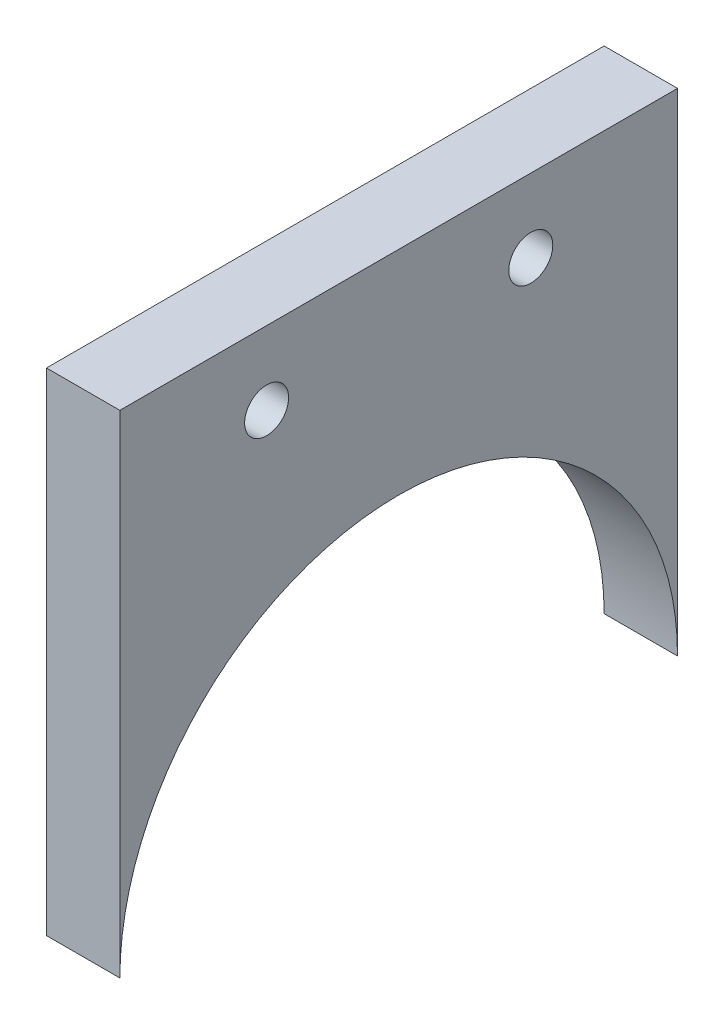
ISO-10303-21;
HEADER;
FILE_DESCRIPTION(('STEP AP214'),'2;1');
FILE_NAME('part.step','',(''),(''),'','','');
FILE_SCHEMA(('AUTOMOTIVE_DESIGN { 1 0 10303 214 1 1 1 1 }'));
ENDSEC;
DATA;
#1=APPLICATION_CONTEXT('core data for automotive mechanical design processes');
#2=APPLICATION_PROTOCOL_DEFINITION('international standard','automotive_design',2000,#1);
#3=PRODUCT_CONTEXT('',#1,'mechanical');
#4=PRODUCT('Part','Part','',(#3));
#5=PRODUCT_RELATED_PRODUCT_CATEGORY('part','',(#4));
#6=PRODUCT_DEFINITION_FORMATION('','',#4);
#7=PRODUCT_DEFINITION_CONTEXT('part definition',#1,'design');
#8=PRODUCT_DEFINITION('design','',#6,#7);
#9=PRODUCT_DEFINITION_SHAPE('','',#8);
#10=(LENGTH_UNIT() NAMED_UNIT(*) SI_UNIT(.MILLI.,.METRE.));
#11=(NAMED_UNIT(*) PLANE_ANGLE_UNIT() SI_UNIT($,.RADIAN.));
#12=(NAMED_UNIT(*) SI_UNIT($,.STERADIAN.) SOLID_ANGLE_UNIT());
#13=UNCERTAINTY_MEASURE_WITH_UNIT(LENGTH_MEASURE(1.E-05),#10,'distance_accuracy_value','');
#14=(GEOMETRIC_REPRESENTATION_CONTEXT(3) GLOBAL_UNCERTAINTY_ASSIGNED_CONTEXT((#13)) GLOBAL_UNIT_ASSIGNED_CONTEXT((#10,
#11,#12)) REPRESENTATION_CONTEXT('',''));
#15=CARTESIAN_POINT('',(0.,0.,0.));
#16=DIRECTION('',(0.,0.,1.));
#17=DIRECTION('',(1.,0.,0.));
#18=AXIS2_PLACEMENT_3D('',#15,#16,#17);
#19=CARTESIAN_POINT('',(5.,16.75,19.));
#20=DIRECTION('',(0.,0.,-1.));
#21=DIRECTION('',(0.,1.,0.));
#22=AXIS2_PLACEMENT_3D('',#19,#20,#21);
#23=PLANE('',#22);
#24=DIRECTION('',(0.,-1.,0.));
#25=VECTOR('',#24,1.);
#26=CARTESIAN_POINT('',(0.,16.75,19.));
#27=LINE('',#26,#25);
#28=CARTESIAN_POINT('',(0.,16.75,19.));
#29=VERTEX_POINT('',#28);
#30=CARTESIAN_POINT('',(0.,-16.75,19.));
#31=VERTEX_POINT('',#30);
#32=EDGE_CURVE('E85',#29,#31,#27,.T.);
#33=ORIENTED_EDGE('',*,*,#32,.T.);
#34=DIRECTION('',(-1.,0.,0.));
#35=VECTOR('',#34,1.);
#36=CARTESIAN_POINT('',(5.,-16.75,19.));
#37=LINE('',#36,#35);
#38=CARTESIAN_POINT('',(5.,-16.75,19.));
#39=VERTEX_POINT('',#38);
#40=EDGE_CURVE('E11',#39,#31,#37,.T.);
#41=ORIENTED_EDGE('',*,*,#40,.F.);
#42=DIRECTION('',(0.,-1.,0.));
#43=VECTOR('',#42,1.);
#44=CARTESIAN_POINT('',(5.,16.75,19.));
#45=LINE('',#44,#43);
#46=CARTESIAN_POINT('',(5.,16.75,19.));
#47=VERTEX_POINT('',#46);
#48=EDGE_CURVE('E80',#47,#39,#45,.T.);
#49=ORIENTED_EDGE('',*,*,#48,.F.);
#50=DIRECTION('',(-1.,0.,0.));
#51=VECTOR('',#50,1.);
#52=CARTESIAN_POINT('',(5.,16.75,19.));
#53=LINE('',#52,#51);
#54=EDGE_CURVE('E75',#47,#29,#53,.T.);
#55=ORIENTED_EDGE('',*,*,#54,.T.);
#56=EDGE_LOOP('',(#33,#41,#49,#55));
#57=FACE_BOUND('',#56,.T.);
#58=ADVANCED_FACE('F38',(#57),#23,.F.);
#59=CARTESIAN_POINT('',(5.,16.75,-19.));
#60=DIRECTION('',(0.,0.,1.));
#61=DIRECTION('',(0.,-1.,0.));
#62=AXIS2_PLACEMENT_3D('',#59,#60,#61);
#63=PLANE('',#62);
#64=DIRECTION('',(0.,1.,0.));
#65=VECTOR('',#64,1.);
#66=CARTESIAN_POINT('',(0.,16.75,-19.));
#67=LINE('',#66,#65);
#68=CARTESIAN_POINT('',(0.,-16.75,-19.));
#69=VERTEX_POINT('',#68);
#70=CARTESIAN_POINT('',(0.,16.75,-19.));
#71=VERTEX_POINT('',#70);
#72=EDGE_CURVE('E67',#69,#71,#67,.T.);
#73=ORIENTED_EDGE('',*,*,#72,.T.);
#74=DIRECTION('',(-1.,0.,0.));
#75=VECTOR('',#74,1.);
#76=CARTESIAN_POINT('',(5.,16.75,-19.));
#77=LINE('',#76,#75);
#78=CARTESIAN_POINT('',(5.,16.75,-19.));
#79=VERTEX_POINT('',#78);
#80=EDGE_CURVE('E77',#79,#71,#77,.T.);
#81=ORIENTED_EDGE('',*,*,#80,.F.);
#82=DIRECTION('',(0.,1.,0.));
#83=VECTOR('',#82,1.);
#84=CARTESIAN_POINT('',(5.,16.75,-19.));
#85=LINE('',#84,#83);
#86=CARTESIAN_POINT('',(5.,-16.75,-19.));
#87=VERTEX_POINT('',#86);
#88=EDGE_CURVE('E103',#87,#79,#85,.T.);
#89=ORIENTED_EDGE('',*,*,#88,.F.);
#90=DIRECTION('',(-1.,0.,0.));
#91=VECTOR('',#90,1.);
#92=CARTESIAN_POINT('',(5.,-16.75,-19.));
#93=LINE('',#92,#91);
#94=EDGE_CURVE('E46',#87,#69,#93,.T.);
#95=ORIENTED_EDGE('',*,*,#94,.T.);
#96=EDGE_LOOP('',(#73,#81,#89,#95));
#97=FACE_BOUND('',#96,.T.);
#98=ADVANCED_FACE('F101',(#97),#63,.F.);
#99=CARTESIAN_POINT('',(5.,16.75,19.));
#100=DIRECTION('',(0.,-1.,0.));
#101=DIRECTION('',(0.,0.,-1.));
#102=AXIS2_PLACEMENT_3D('',#99,#100,#101);
#103=PLANE('',#102);
#104=DIRECTION('',(0.,0.,1.));
#105=VECTOR('',#104,1.);
#106=CARTESIAN_POINT('',(0.,16.75,19.));
#107=LINE('',#106,#105);
#108=EDGE_CURVE('E72',#71,#29,#107,.T.);
#109=ORIENTED_EDGE('',*,*,#108,.T.);
#110=ORIENTED_EDGE('',*,*,#54,.F.);
#111=DIRECTION('',(0.,0.,1.));
#112=VECTOR('',#111,1.);
#113=CARTESIAN_POINT('',(5.,16.75,19.));
#114=LINE('',#113,#112);
#115=EDGE_CURVE('E54',#79,#47,#114,.T.);
#116=ORIENTED_EDGE('',*,*,#115,.F.);
#117=ORIENTED_EDGE('',*,*,#80,.T.);
#118=EDGE_LOOP('',(#109,#110,#116,#117));
#119=FACE_BOUND('',#118,.T.);
#120=ADVANCED_FACE('F74',(#119),#103,.F.);
#121=CARTESIAN_POINT('',(5.,0.,0.));
#122=DIRECTION('',(1.,0.,0.));
#123=DIRECTION('',(0.,0.,-1.));
#124=AXIS2_PLACEMENT_3D('',#121,#122,#123);
#125=PLANE('',#124);
#126=CARTESIAN_POINT('',(5.,11.75,-9.00000000000002));
#127=DIRECTION('',(1.,0.,0.));
#128=DIRECTION('',(0.,0.,-1.));
#129=AXIS2_PLACEMENT_3D('',#126,#127,#128);
#130=CIRCLE('',#129,1.5);
#131=CARTESIAN_POINT('',(5.,11.75,-10.5));
#132=VERTEX_POINT('',#131);
#133=EDGE_CURVE('E118',#132,#132,#130,.T.);
#134=ORIENTED_EDGE('',*,*,#133,.F.);
#135=EDGE_LOOP('',(#134));
#136=FACE_BOUND('',#135,.T.);
#137=CARTESIAN_POINT('',(5.,11.75,8.99999999999999));
#138=DIRECTION('',(1.,0.,0.));
#139=DIRECTION('',(0.,0.,-1.));
#140=AXIS2_PLACEMENT_3D('',#137,#138,#139);
#141=CIRCLE('',#140,1.5);
#142=CARTESIAN_POINT('',(5.,11.75,7.49999999999999));
#143=VERTEX_POINT('',#142);
#144=EDGE_CURVE('E113',#143,#143,#141,.T.);
#145=ORIENTED_EDGE('',*,*,#144,.F.);
#146=EDGE_LOOP('',(#145));
#147=FACE_BOUND('',#146,.T.);
#148=ORIENTED_EDGE('',*,*,#48,.T.);
#149=CARTESIAN_POINT('',(5.,-16.75,0.));
#150=DIRECTION('',(1.,0.,0.));
#151=DIRECTION('',(0.,0.,-1.));
#152=AXIS2_PLACEMENT_3D('',#149,#150,#151);
#153=CIRCLE('',#152,19.);
#154=EDGE_CURVE('E91',#87,#39,#153,.T.);
#155=ORIENTED_EDGE('',*,*,#154,.F.);
#156=ORIENTED_EDGE('',*,*,#88,.T.);
#157=ORIENTED_EDGE('',*,*,#115,.T.);
#158=EDGE_LOOP('',(#148,#155,#156,#157));
#159=FACE_BOUND('',#158,.T.);
#160=ADVANCED_FACE('F109',(#136,#147,#159),#125,.T.);
#161=CARTESIAN_POINT('',(0.,0.,0.));
#162=DIRECTION('',(1.,0.,0.));
#163=DIRECTION('',(0.,0.,-1.));
#164=AXIS2_PLACEMENT_3D('',#161,#162,#163);
#165=PLANE('',#164);
#166=CARTESIAN_POINT('',(0.,11.75,-9.00000000000002));
#167=DIRECTION('',(1.,0.,0.));
#168=DIRECTION('',(0.,0.,-1.));
#169=AXIS2_PLACEMENT_3D('',#166,#167,#168);
#170=CIRCLE('',#169,1.5);
#171=CARTESIAN_POINT('',(0.,11.75,-10.5));
#172=VERTEX_POINT('',#171);
#173=EDGE_CURVE('E121',#172,#172,#170,.T.);
#174=ORIENTED_EDGE('',*,*,#173,.T.);
#175=EDGE_LOOP('',(#174));
#176=FACE_BOUND('',#175,.T.);
#177=CARTESIAN_POINT('',(0.,11.75,8.99999999999999));
#178=DIRECTION('',(1.,0.,0.));
#179=DIRECTION('',(0.,0.,-1.));
#180=AXIS2_PLACEMENT_3D('',#177,#178,#179);
#181=CIRCLE('',#180,1.5);
#182=CARTESIAN_POINT('',(0.,11.75,7.49999999999999));
#183=VERTEX_POINT('',#182);
#184=EDGE_CURVE('E115',#183,#183,#181,.T.);
#185=ORIENTED_EDGE('',*,*,#184,.T.);
#186=EDGE_LOOP('',(#185));
#187=FACE_BOUND('',#186,.T.);
#188=CARTESIAN_POINT('',(0.,-16.75,0.));
#189=DIRECTION('',(1.,0.,0.));
#190=DIRECTION('',(0.,0.,-1.));
#191=AXIS2_PLACEMENT_3D('',#188,#189,#190);
#192=CIRCLE('',#191,19.);
#193=EDGE_CURVE('E90',#69,#31,#192,.T.);
#194=ORIENTED_EDGE('',*,*,#193,.T.);
#195=ORIENTED_EDGE('',*,*,#32,.F.);
#196=ORIENTED_EDGE('',*,*,#108,.F.);
#197=ORIENTED_EDGE('',*,*,#72,.F.);
#198=EDGE_LOOP('',(#194,#195,#196,#197));
#199=FACE_BOUND('',#198,.T.);
#200=ADVANCED_FACE('F88',(#176,#187,#199),#165,.F.);
#201=CARTESIAN_POINT('',(5.,-16.75,0.));
#202=DIRECTION('',(-1.,0.,0.));
#203=DIRECTION('',(0.,0.,1.));
#204=AXIS2_PLACEMENT_3D('',#201,#202,#203);
#205=CYLINDRICAL_SURFACE('',#204,19.);
#206=ORIENTED_EDGE('',*,*,#40,.T.);
#207=ORIENTED_EDGE('',*,*,#193,.F.);
#208=ORIENTED_EDGE('',*,*,#94,.F.);
#209=ORIENTED_EDGE('',*,*,#154,.T.);
#210=EDGE_LOOP('',(#206,#207,#208,#209));
#211=FACE_BOUND('',#210,.T.);
#212=ADVANCED_FACE('F107',(#211),#205,.F.);
#213=CARTESIAN_POINT('',(5.,11.75,8.99999999999999));
#214=DIRECTION('',(-1.,0.,0.));
#215=DIRECTION('',(0.,0.,1.));
#216=AXIS2_PLACEMENT_3D('',#213,#214,#215);
#217=CYLINDRICAL_SURFACE('',#216,1.5);
#218=ORIENTED_EDGE('',*,*,#144,.T.);
#219=EDGE_LOOP('',(#218));
#220=FACE_BOUND('',#219,.T.);
#221=ORIENTED_EDGE('',*,*,#184,.F.);
#222=EDGE_LOOP('',(#221));
#223=FACE_BOUND('',#222,.T.);
#224=ADVANCED_FACE('F135',(#220,#223),#217,.F.);
#225=CARTESIAN_POINT('',(5.,11.75,-9.00000000000002));
#226=DIRECTION('',(-1.,0.,0.));
#227=DIRECTION('',(0.,0.,1.));
#228=AXIS2_PLACEMENT_3D('',#225,#226,#227);
#229=CYLINDRICAL_SURFACE('',#228,1.5);
#230=ORIENTED_EDGE('',*,*,#133,.T.);
#231=EDGE_LOOP('',(#230));
#232=FACE_BOUND('',#231,.T.);
#233=ORIENTED_EDGE('',*,*,#173,.F.);
#234=EDGE_LOOP('',(#233));
#235=FACE_BOUND('',#234,.T.);
#236=ADVANCED_FACE('F127',(#232,#235),#229,.F.);
#237=CLOSED_SHELL('',(#58,#98,#120,#160,#200,#212,#224,#236));
#238=MANIFOLD_SOLID_BREP('B2',#237);
#239=ADVANCED_BREP_SHAPE_REPRESENTATION('',(#18,#238),#14);
#240=SHAPE_DEFINITION_REPRESENTATION(#9,#239);
ENDSEC;
END-ISO-10303-21;
